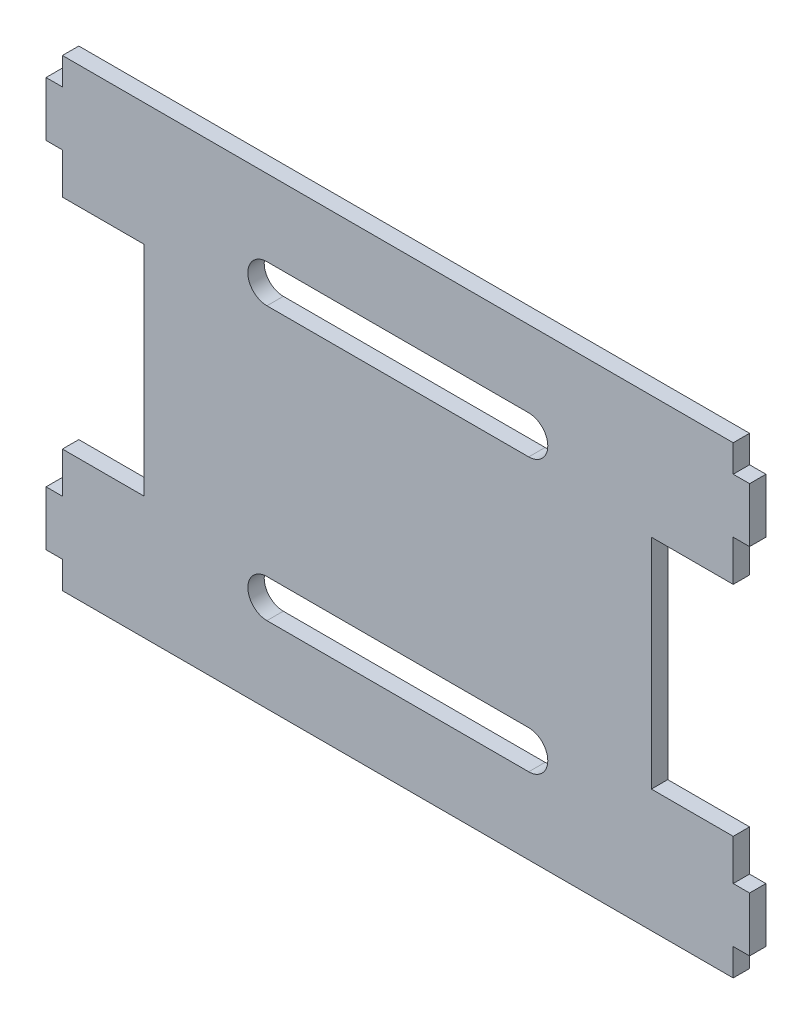
ISO-10303-21;
HEADER;
FILE_DESCRIPTION(('STEP AP214'),'2;1');
FILE_NAME('part.step','',(''),(''),'','','');
FILE_SCHEMA(('AUTOMOTIVE_DESIGN { 1 0 10303 214 1 1 1 1 }'));
ENDSEC;
DATA;
#1=APPLICATION_CONTEXT('core data for automotive mechanical design processes');
#2=APPLICATION_PROTOCOL_DEFINITION('international standard','automotive_design',2000,#1);
#3=PRODUCT_CONTEXT('',#1,'mechanical');
#4=PRODUCT('Part','Part','',(#3));
#5=PRODUCT_RELATED_PRODUCT_CATEGORY('part','',(#4));
#6=PRODUCT_DEFINITION_FORMATION('','',#4);
#7=PRODUCT_DEFINITION_CONTEXT('part definition',#1,'design');
#8=PRODUCT_DEFINITION('design','',#6,#7);
#9=PRODUCT_DEFINITION_SHAPE('','',#8);
#10=(LENGTH_UNIT() NAMED_UNIT(*) SI_UNIT(.MILLI.,.METRE.));
#11=(NAMED_UNIT(*) PLANE_ANGLE_UNIT() SI_UNIT($,.RADIAN.));
#12=(NAMED_UNIT(*) SI_UNIT($,.STERADIAN.) SOLID_ANGLE_UNIT());
#13=UNCERTAINTY_MEASURE_WITH_UNIT(LENGTH_MEASURE(1.E-05),#10,'distance_accuracy_value','');
#14=(GEOMETRIC_REPRESENTATION_CONTEXT(3) GLOBAL_UNCERTAINTY_ASSIGNED_CONTEXT((#13)) GLOBAL_UNIT_ASSIGNED_CONTEXT((#10,
#11,#12)) REPRESENTATION_CONTEXT('',''));
#15=CARTESIAN_POINT('',(0.,0.,0.));
#16=DIRECTION('',(0.,0.,1.));
#17=DIRECTION('',(1.,0.,0.));
#18=AXIS2_PLACEMENT_3D('',#15,#16,#17);
#19=CARTESIAN_POINT('',(0.,0.,3.));
#20=DIRECTION('',(0.,0.,1.));
#21=DIRECTION('',(1.,0.,0.));
#22=AXIS2_PLACEMENT_3D('',#19,#20,#21);
#23=PLANE('',#22);
#24=DIRECTION('',(0.,1.,0.));
#25=VECTOR('',#24,1.);
#26=CARTESIAN_POINT('',(61.5,-37.5,3.));
#27=LINE('',#26,#25);
#28=CARTESIAN_POINT('',(61.5,-42.5,3.));
#29=VERTEX_POINT('',#28);
#30=CARTESIAN_POINT('',(61.5,-37.5,3.));
#31=VERTEX_POINT('',#30);
#32=EDGE_CURVE('E333',#29,#31,#27,.T.);
#33=ORIENTED_EDGE('',*,*,#32,.T.);
#34=DIRECTION('',(1.,0.,0.));
#35=VECTOR('',#34,1.);
#36=CARTESIAN_POINT('',(61.5,-37.5,3.));
#37=LINE('',#36,#35);
#38=CARTESIAN_POINT('',(64.5,-37.5,3.));
#39=VERTEX_POINT('',#38);
#40=EDGE_CURVE('E336',#31,#39,#37,.T.);
#41=ORIENTED_EDGE('',*,*,#40,.T.);
#42=DIRECTION('',(0.,1.,0.));
#43=VECTOR('',#42,1.);
#44=CARTESIAN_POINT('',(64.5,-27.5,3.));
#45=LINE('',#44,#43);
#46=CARTESIAN_POINT('',(64.5,-27.5,3.));
#47=VERTEX_POINT('',#46);
#48=EDGE_CURVE('E339',#39,#47,#45,.T.);
#49=ORIENTED_EDGE('',*,*,#48,.T.);
#50=DIRECTION('',(-1.,0.,0.));
#51=VECTOR('',#50,1.);
#52=CARTESIAN_POINT('',(61.5,-27.5,3.));
#53=LINE('',#52,#51);
#54=CARTESIAN_POINT('',(61.5,-27.5,3.));
#55=VERTEX_POINT('',#54);
#56=EDGE_CURVE('E341',#47,#55,#53,.T.);
#57=ORIENTED_EDGE('',*,*,#56,.T.);
#58=DIRECTION('',(0.,1.,0.));
#59=VECTOR('',#58,1.);
#60=CARTESIAN_POINT('',(61.5,-19.9999999999999,3.));
#61=LINE('',#60,#59);
#62=CARTESIAN_POINT('',(61.5,-19.9999999999999,3.));
#63=VERTEX_POINT('',#62);
#64=EDGE_CURVE('E343',#55,#63,#61,.T.);
#65=ORIENTED_EDGE('',*,*,#64,.T.);
#66=DIRECTION('',(-1.,0.,0.));
#67=VECTOR('',#66,1.);
#68=CARTESIAN_POINT('',(61.5,-19.9999999999999,3.));
#69=LINE('',#68,#67);
#70=CARTESIAN_POINT('',(46.5,-20.,3.));
#71=VERTEX_POINT('',#70);
#72=EDGE_CURVE('E345',#63,#71,#69,.T.);
#73=ORIENTED_EDGE('',*,*,#72,.T.);
#74=DIRECTION('',(0.,1.,0.));
#75=VECTOR('',#74,1.);
#76=CARTESIAN_POINT('',(46.5,20.,3.));
#77=LINE('',#76,#75);
#78=CARTESIAN_POINT('',(46.5,20.,3.));
#79=VERTEX_POINT('',#78);
#80=EDGE_CURVE('E347',#71,#79,#77,.T.);
#81=ORIENTED_EDGE('',*,*,#80,.T.);
#82=DIRECTION('',(1.,0.,0.));
#83=VECTOR('',#82,1.);
#84=CARTESIAN_POINT('',(61.5,20.0000000000001,3.));
#85=LINE('',#84,#83);
#86=CARTESIAN_POINT('',(61.5,20.0000000000001,3.));
#87=VERTEX_POINT('',#86);
#88=EDGE_CURVE('E349',#79,#87,#85,.T.);
#89=ORIENTED_EDGE('',*,*,#88,.T.);
#90=DIRECTION('',(0.,1.,0.));
#91=VECTOR('',#90,1.);
#92=CARTESIAN_POINT('',(61.5,27.5,3.));
#93=LINE('',#92,#91);
#94=CARTESIAN_POINT('',(61.5,27.5,3.));
#95=VERTEX_POINT('',#94);
#96=EDGE_CURVE('E351',#87,#95,#93,.T.);
#97=ORIENTED_EDGE('',*,*,#96,.T.);
#98=DIRECTION('',(1.,0.,0.));
#99=VECTOR('',#98,1.);
#100=CARTESIAN_POINT('',(61.5,27.5,3.));
#101=LINE('',#100,#99);
#102=CARTESIAN_POINT('',(64.5,27.5,3.));
#103=VERTEX_POINT('',#102);
#104=EDGE_CURVE('E353',#95,#103,#101,.T.);
#105=ORIENTED_EDGE('',*,*,#104,.T.);
#106=DIRECTION('',(0.,1.,0.));
#107=VECTOR('',#106,1.);
#108=CARTESIAN_POINT('',(64.5,37.5,3.));
#109=LINE('',#108,#107);
#110=CARTESIAN_POINT('',(64.5,37.5,3.));
#111=VERTEX_POINT('',#110);
#112=EDGE_CURVE('E355',#103,#111,#109,.T.);
#113=ORIENTED_EDGE('',*,*,#112,.T.);
#114=DIRECTION('',(-1.,0.,0.));
#115=VECTOR('',#114,1.);
#116=CARTESIAN_POINT('',(61.5,37.5,3.));
#117=LINE('',#116,#115);
#118=CARTESIAN_POINT('',(61.5,37.5,3.));
#119=VERTEX_POINT('',#118);
#120=EDGE_CURVE('E357',#111,#119,#117,.T.);
#121=ORIENTED_EDGE('',*,*,#120,.T.);
#122=DIRECTION('',(0.,1.,0.));
#123=VECTOR('',#122,1.);
#124=CARTESIAN_POINT('',(61.5,42.5,3.));
#125=LINE('',#124,#123);
#126=CARTESIAN_POINT('',(61.5,42.5,3.));
#127=VERTEX_POINT('',#126);
#128=EDGE_CURVE('E359',#119,#127,#125,.T.);
#129=ORIENTED_EDGE('',*,*,#128,.T.);
#130=DIRECTION('',(-1.,0.,0.));
#131=VECTOR('',#130,1.);
#132=CARTESIAN_POINT('',(-61.5,42.5,3.));
#133=LINE('',#132,#131);
#134=CARTESIAN_POINT('',(-61.5,42.5,3.));
#135=VERTEX_POINT('',#134);
#136=EDGE_CURVE('E361',#127,#135,#133,.T.);
#137=ORIENTED_EDGE('',*,*,#136,.T.);
#138=DIRECTION('',(0.,-1.,0.));
#139=VECTOR('',#138,1.);
#140=CARTESIAN_POINT('',(-61.5,42.5,3.));
#141=LINE('',#140,#139);
#142=CARTESIAN_POINT('',(-61.5,37.5,3.));
#143=VERTEX_POINT('',#142);
#144=EDGE_CURVE('E363',#135,#143,#141,.T.);
#145=ORIENTED_EDGE('',*,*,#144,.T.);
#146=DIRECTION('',(-1.,0.,0.));
#147=VECTOR('',#146,1.);
#148=CARTESIAN_POINT('',(-64.5,37.5,3.));
#149=LINE('',#148,#147);
#150=CARTESIAN_POINT('',(-64.5,37.5,3.));
#151=VERTEX_POINT('',#150);
#152=EDGE_CURVE('E365',#143,#151,#149,.T.);
#153=ORIENTED_EDGE('',*,*,#152,.T.);
#154=DIRECTION('',(0.,-1.,0.));
#155=VECTOR('',#154,1.);
#156=CARTESIAN_POINT('',(-64.5,37.5,3.));
#157=LINE('',#156,#155);
#158=CARTESIAN_POINT('',(-64.5,27.5,3.));
#159=VERTEX_POINT('',#158);
#160=EDGE_CURVE('E367',#151,#159,#157,.T.);
#161=ORIENTED_EDGE('',*,*,#160,.T.);
#162=DIRECTION('',(1.,0.,0.));
#163=VECTOR('',#162,1.);
#164=CARTESIAN_POINT('',(-64.5,27.5,3.));
#165=LINE('',#164,#163);
#166=CARTESIAN_POINT('',(-61.5,27.5,3.));
#167=VERTEX_POINT('',#166);
#168=EDGE_CURVE('E369',#159,#167,#165,.T.);
#169=ORIENTED_EDGE('',*,*,#168,.T.);
#170=DIRECTION('',(0.,-1.,0.));
#171=VECTOR('',#170,1.);
#172=CARTESIAN_POINT('',(-61.5,27.5,3.));
#173=LINE('',#172,#171);
#174=CARTESIAN_POINT('',(-61.5,20.,3.));
#175=VERTEX_POINT('',#174);
#176=EDGE_CURVE('E371',#167,#175,#173,.T.);
#177=ORIENTED_EDGE('',*,*,#176,.T.);
#178=DIRECTION('',(1.,0.,0.));
#179=VECTOR('',#178,1.);
#180=CARTESIAN_POINT('',(-61.5,20.,3.));
#181=LINE('',#180,#179);
#182=CARTESIAN_POINT('',(-46.5,20.,3.));
#183=VERTEX_POINT('',#182);
#184=EDGE_CURVE('E373',#175,#183,#181,.T.);
#185=ORIENTED_EDGE('',*,*,#184,.T.);
#186=DIRECTION('',(0.,-1.,0.));
#187=VECTOR('',#186,1.);
#188=CARTESIAN_POINT('',(-46.5,20.,3.));
#189=LINE('',#188,#187);
#190=CARTESIAN_POINT('',(-46.5,-20.,3.));
#191=VERTEX_POINT('',#190);
#192=EDGE_CURVE('E375',#183,#191,#189,.T.);
#193=ORIENTED_EDGE('',*,*,#192,.T.);
#194=DIRECTION('',(-1.,0.,0.));
#195=VECTOR('',#194,1.);
#196=CARTESIAN_POINT('',(-61.5,-20.,3.));
#197=LINE('',#196,#195);
#198=CARTESIAN_POINT('',(-61.5,-20.,3.));
#199=VERTEX_POINT('',#198);
#200=EDGE_CURVE('E377',#191,#199,#197,.T.);
#201=ORIENTED_EDGE('',*,*,#200,.T.);
#202=DIRECTION('',(0.,-1.,0.));
#203=VECTOR('',#202,1.);
#204=CARTESIAN_POINT('',(-61.5,-20.,3.));
#205=LINE('',#204,#203);
#206=CARTESIAN_POINT('',(-61.5,-27.5,3.));
#207=VERTEX_POINT('',#206);
#208=EDGE_CURVE('E379',#199,#207,#205,.T.);
#209=ORIENTED_EDGE('',*,*,#208,.T.);
#210=DIRECTION('',(-1.,0.,0.));
#211=VECTOR('',#210,1.);
#212=CARTESIAN_POINT('',(-64.5,-27.5,3.));
#213=LINE('',#212,#211);
#214=CARTESIAN_POINT('',(-64.5,-27.5,3.));
#215=VERTEX_POINT('',#214);
#216=EDGE_CURVE('E381',#207,#215,#213,.T.);
#217=ORIENTED_EDGE('',*,*,#216,.T.);
#218=DIRECTION('',(0.,-1.,0.));
#219=VECTOR('',#218,1.);
#220=CARTESIAN_POINT('',(-64.5,-27.5,3.));
#221=LINE('',#220,#219);
#222=CARTESIAN_POINT('',(-64.5,-37.5,3.));
#223=VERTEX_POINT('',#222);
#224=EDGE_CURVE('E383',#215,#223,#221,.T.);
#225=ORIENTED_EDGE('',*,*,#224,.T.);
#226=DIRECTION('',(1.,0.,0.));
#227=VECTOR('',#226,1.);
#228=CARTESIAN_POINT('',(-64.5,-37.5,3.));
#229=LINE('',#228,#227);
#230=CARTESIAN_POINT('',(-61.5,-37.5,3.));
#231=VERTEX_POINT('',#230);
#232=EDGE_CURVE('E385',#223,#231,#229,.T.);
#233=ORIENTED_EDGE('',*,*,#232,.T.);
#234=DIRECTION('',(0.,-1.,0.));
#235=VECTOR('',#234,1.);
#236=CARTESIAN_POINT('',(-61.5,-37.5,3.));
#237=LINE('',#236,#235);
#238=CARTESIAN_POINT('',(-61.5,-42.5,3.));
#239=VERTEX_POINT('',#238);
#240=EDGE_CURVE('E387',#231,#239,#237,.T.);
#241=ORIENTED_EDGE('',*,*,#240,.T.);
#242=DIRECTION('',(1.,0.,0.));
#243=VECTOR('',#242,1.);
#244=CARTESIAN_POINT('',(-61.5,-42.5,3.));
#245=LINE('',#244,#243);
#246=EDGE_CURVE('E389',#239,#29,#245,.T.);
#247=ORIENTED_EDGE('',*,*,#246,.T.);
#248=EDGE_LOOP('',(#33,#41,#49,#57,#65,#73,#81,#89,#97,#105,#113,#121,#129,#137,#145,#153,#161,
#169,#177,#185,#193,#201,#209,#217,#225,#233,#241,#247));
#249=FACE_BOUND('',#248,.T.);
#250=DIRECTION('',(1.,0.,0.));
#251=VECTOR('',#250,1.);
#252=CARTESIAN_POINT('',(-24.,21.5,3.));
#253=LINE('',#252,#251);
#254=CARTESIAN_POINT('',(-24.,21.5,3.));
#255=VERTEX_POINT('',#254);
#256=CARTESIAN_POINT('',(24.,21.5,3.));
#257=VERTEX_POINT('',#256);
#258=EDGE_CURVE('E304',#255,#257,#253,.T.);
#259=ORIENTED_EDGE('',*,*,#258,.F.);
#260=CARTESIAN_POINT('',(-24.,25.,3.));
#261=DIRECTION('',(0.,0.,1.));
#262=DIRECTION('',(1.,0.,0.));
#263=AXIS2_PLACEMENT_3D('',#260,#261,#262);
#264=CIRCLE('',#263,3.5);
#265=CARTESIAN_POINT('',(-24.,28.5,3.));
#266=VERTEX_POINT('',#265);
#267=EDGE_CURVE('E302',#266,#255,#264,.T.);
#268=ORIENTED_EDGE('',*,*,#267,.F.);
#269=DIRECTION('',(-1.,0.,0.));
#270=VECTOR('',#269,1.);
#271=CARTESIAN_POINT('',(-24.,28.5,3.));
#272=LINE('',#271,#270);
#273=CARTESIAN_POINT('',(24.,28.5,3.));
#274=VERTEX_POINT('',#273);
#275=EDGE_CURVE('E310',#274,#266,#272,.T.);
#276=ORIENTED_EDGE('',*,*,#275,.F.);
#277=CARTESIAN_POINT('',(24.,25.,3.));
#278=DIRECTION('',(0.,0.,1.));
#279=DIRECTION('',(1.,0.,0.));
#280=AXIS2_PLACEMENT_3D('',#277,#278,#279);
#281=CIRCLE('',#280,3.5);
#282=EDGE_CURVE('E307',#257,#274,#281,.T.);
#283=ORIENTED_EDGE('',*,*,#282,.F.);
#284=EDGE_LOOP('',(#259,#268,#276,#283));
#285=FACE_BOUND('',#284,.T.);
#286=DIRECTION('',(1.,0.,0.));
#287=VECTOR('',#286,1.);
#288=CARTESIAN_POINT('',(-24.,-28.5,3.));
#289=LINE('',#288,#287);
#290=CARTESIAN_POINT('',(-24.,-28.5,3.));
#291=VERTEX_POINT('',#290);
#292=CARTESIAN_POINT('',(24.,-28.5,3.));
#293=VERTEX_POINT('',#292);
#294=EDGE_CURVE('E274',#291,#293,#289,.T.);
#295=ORIENTED_EDGE('',*,*,#294,.F.);
#296=CARTESIAN_POINT('',(-24.,-25.,3.));
#297=DIRECTION('',(0.,0.,1.));
#298=DIRECTION('',(1.,0.,0.));
#299=AXIS2_PLACEMENT_3D('',#296,#297,#298);
#300=CIRCLE('',#299,3.5);
#301=CARTESIAN_POINT('',(-24.,-21.5,3.));
#302=VERTEX_POINT('',#301);
#303=EDGE_CURVE('E266',#302,#291,#300,.T.);
#304=ORIENTED_EDGE('',*,*,#303,.F.);
#305=DIRECTION('',(-1.,0.,0.));
#306=VECTOR('',#305,1.);
#307=CARTESIAN_POINT('',(-24.,-21.5,3.));
#308=LINE('',#307,#306);
#309=CARTESIAN_POINT('',(24.,-21.5,3.));
#310=VERTEX_POINT('',#309);
#311=EDGE_CURVE('E288',#310,#302,#308,.T.);
#312=ORIENTED_EDGE('',*,*,#311,.F.);
#313=CARTESIAN_POINT('',(24.,-25.,3.));
#314=DIRECTION('',(0.,0.,1.));
#315=DIRECTION('',(1.,0.,0.));
#316=AXIS2_PLACEMENT_3D('',#313,#314,#315);
#317=CIRCLE('',#316,3.5);
#318=EDGE_CURVE('E286',#293,#310,#317,.T.);
#319=ORIENTED_EDGE('',*,*,#318,.F.);
#320=EDGE_LOOP('',(#295,#304,#312,#319));
#321=FACE_BOUND('',#320,.T.);
#322=ADVANCED_FACE('F33',(#249,#285,#321),#23,.T.);
#323=CARTESIAN_POINT('',(0.,0.,0.));
#324=DIRECTION('',(0.,0.,1.));
#325=DIRECTION('',(1.,0.,0.));
#326=AXIS2_PLACEMENT_3D('',#323,#324,#325);
#327=PLANE('',#326);
#328=CARTESIAN_POINT('',(-24.,25.,0.));
#329=DIRECTION('',(0.,0.,1.));
#330=DIRECTION('',(1.,0.,0.));
#331=AXIS2_PLACEMENT_3D('',#328,#329,#330);
#332=CIRCLE('',#331,3.5);
#333=CARTESIAN_POINT('',(-24.,28.5,0.));
#334=VERTEX_POINT('',#333);
#335=CARTESIAN_POINT('',(-24.,21.5,0.));
#336=VERTEX_POINT('',#335);
#337=EDGE_CURVE('E282',#334,#336,#332,.T.);
#338=ORIENTED_EDGE('',*,*,#337,.T.);
#339=DIRECTION('',(1.,0.,0.));
#340=VECTOR('',#339,1.);
#341=CARTESIAN_POINT('',(-24.,21.5,0.));
#342=LINE('',#341,#340);
#343=CARTESIAN_POINT('',(24.,21.5,0.));
#344=VERTEX_POINT('',#343);
#345=EDGE_CURVE('E315',#336,#344,#342,.T.);
#346=ORIENTED_EDGE('',*,*,#345,.T.);
#347=CARTESIAN_POINT('',(24.,25.,0.));
#348=DIRECTION('',(0.,0.,1.));
#349=DIRECTION('',(1.,0.,0.));
#350=AXIS2_PLACEMENT_3D('',#347,#348,#349);
#351=CIRCLE('',#350,3.5);
#352=CARTESIAN_POINT('',(24.,28.5,0.));
#353=VERTEX_POINT('',#352);
#354=EDGE_CURVE('E318',#344,#353,#351,.T.);
#355=ORIENTED_EDGE('',*,*,#354,.T.);
#356=DIRECTION('',(-1.,0.,0.));
#357=VECTOR('',#356,1.);
#358=CARTESIAN_POINT('',(-24.,28.5,0.));
#359=LINE('',#358,#357);
#360=EDGE_CURVE('E305',#353,#334,#359,.T.);
#361=ORIENTED_EDGE('',*,*,#360,.T.);
#362=EDGE_LOOP('',(#338,#346,#355,#361));
#363=FACE_BOUND('',#362,.T.);
#364=DIRECTION('',(0.,1.,0.));
#365=VECTOR('',#364,1.);
#366=CARTESIAN_POINT('',(61.5,-37.5,0.));
#367=LINE('',#366,#365);
#368=CARTESIAN_POINT('',(61.5,-42.5,0.));
#369=VERTEX_POINT('',#368);
#370=CARTESIAN_POINT('',(61.5,-37.5,0.));
#371=VERTEX_POINT('',#370);
#372=EDGE_CURVE('E332',#369,#371,#367,.T.);
#373=ORIENTED_EDGE('',*,*,#372,.F.);
#374=DIRECTION('',(1.,0.,0.));
#375=VECTOR('',#374,1.);
#376=CARTESIAN_POINT('',(-61.5,-42.5,0.));
#377=LINE('',#376,#375);
#378=CARTESIAN_POINT('',(-61.5,-42.5,0.));
#379=VERTEX_POINT('',#378);
#380=EDGE_CURVE('E337',#379,#369,#377,.T.);
#381=ORIENTED_EDGE('',*,*,#380,.F.);
#382=DIRECTION('',(0.,-1.,0.));
#383=VECTOR('',#382,1.);
#384=CARTESIAN_POINT('',(-61.5,-37.5,0.));
#385=LINE('',#384,#383);
#386=CARTESIAN_POINT('',(-61.5,-37.5,0.));
#387=VERTEX_POINT('',#386);
#388=EDGE_CURVE('E444',#387,#379,#385,.T.);
#389=ORIENTED_EDGE('',*,*,#388,.F.);
#390=DIRECTION('',(1.,0.,0.));
#391=VECTOR('',#390,1.);
#392=CARTESIAN_POINT('',(-64.5,-37.5,0.));
#393=LINE('',#392,#391);
#394=CARTESIAN_POINT('',(-64.5,-37.5,0.));
#395=VERTEX_POINT('',#394);
#396=EDGE_CURVE('E442',#395,#387,#393,.T.);
#397=ORIENTED_EDGE('',*,*,#396,.F.);
#398=DIRECTION('',(0.,-1.,0.));
#399=VECTOR('',#398,1.);
#400=CARTESIAN_POINT('',(-64.5,-27.5,0.));
#401=LINE('',#400,#399);
#402=CARTESIAN_POINT('',(-64.5,-27.5,0.));
#403=VERTEX_POINT('',#402);
#404=EDGE_CURVE('E440',#403,#395,#401,.T.);
#405=ORIENTED_EDGE('',*,*,#404,.F.);
#406=DIRECTION('',(-1.,0.,0.));
#407=VECTOR('',#406,1.);
#408=CARTESIAN_POINT('',(-64.5,-27.5,0.));
#409=LINE('',#408,#407);
#410=CARTESIAN_POINT('',(-61.5,-27.5,0.));
#411=VERTEX_POINT('',#410);
#412=EDGE_CURVE('E438',#411,#403,#409,.T.);
#413=ORIENTED_EDGE('',*,*,#412,.F.);
#414=DIRECTION('',(0.,-1.,0.));
#415=VECTOR('',#414,1.);
#416=CARTESIAN_POINT('',(-61.5,-20.,0.));
#417=LINE('',#416,#415);
#418=CARTESIAN_POINT('',(-61.5,-20.,0.));
#419=VERTEX_POINT('',#418);
#420=EDGE_CURVE('E436',#419,#411,#417,.T.);
#421=ORIENTED_EDGE('',*,*,#420,.F.);
#422=DIRECTION('',(-1.,0.,0.));
#423=VECTOR('',#422,1.);
#424=CARTESIAN_POINT('',(-61.5,-20.,0.));
#425=LINE('',#424,#423);
#426=CARTESIAN_POINT('',(-46.5,-20.,0.));
#427=VERTEX_POINT('',#426);
#428=EDGE_CURVE('E434',#427,#419,#425,.T.);
#429=ORIENTED_EDGE('',*,*,#428,.F.);
#430=DIRECTION('',(0.,-1.,0.));
#431=VECTOR('',#430,1.);
#432=CARTESIAN_POINT('',(-46.5,20.,0.));
#433=LINE('',#432,#431);
#434=CARTESIAN_POINT('',(-46.5,20.,0.));
#435=VERTEX_POINT('',#434);
#436=EDGE_CURVE('E432',#435,#427,#433,.T.);
#437=ORIENTED_EDGE('',*,*,#436,.F.);
#438=DIRECTION('',(1.,0.,0.));
#439=VECTOR('',#438,1.);
#440=CARTESIAN_POINT('',(-61.5,20.,0.));
#441=LINE('',#440,#439);
#442=CARTESIAN_POINT('',(-61.5,20.,0.));
#443=VERTEX_POINT('',#442);
#444=EDGE_CURVE('E430',#443,#435,#441,.T.);
#445=ORIENTED_EDGE('',*,*,#444,.F.);
#446=DIRECTION('',(0.,-1.,0.));
#447=VECTOR('',#446,1.);
#448=CARTESIAN_POINT('',(-61.5,27.5,0.));
#449=LINE('',#448,#447);
#450=CARTESIAN_POINT('',(-61.5,27.5,0.));
#451=VERTEX_POINT('',#450);
#452=EDGE_CURVE('E428',#451,#443,#449,.T.);
#453=ORIENTED_EDGE('',*,*,#452,.F.);
#454=DIRECTION('',(1.,0.,0.));
#455=VECTOR('',#454,1.);
#456=CARTESIAN_POINT('',(-64.5,27.5,0.));
#457=LINE('',#456,#455);
#458=CARTESIAN_POINT('',(-64.5,27.5,0.));
#459=VERTEX_POINT('',#458);
#460=EDGE_CURVE('E426',#459,#451,#457,.T.);
#461=ORIENTED_EDGE('',*,*,#460,.F.);
#462=DIRECTION('',(0.,-1.,0.));
#463=VECTOR('',#462,1.);
#464=CARTESIAN_POINT('',(-64.5,37.5,0.));
#465=LINE('',#464,#463);
#466=CARTESIAN_POINT('',(-64.5,37.5,0.));
#467=VERTEX_POINT('',#466);
#468=EDGE_CURVE('E424',#467,#459,#465,.T.);
#469=ORIENTED_EDGE('',*,*,#468,.F.);
#470=DIRECTION('',(-1.,0.,0.));
#471=VECTOR('',#470,1.);
#472=CARTESIAN_POINT('',(-64.5,37.5,0.));
#473=LINE('',#472,#471);
#474=CARTESIAN_POINT('',(-61.5,37.5,0.));
#475=VERTEX_POINT('',#474);
#476=EDGE_CURVE('E422',#475,#467,#473,.T.);
#477=ORIENTED_EDGE('',*,*,#476,.F.);
#478=DIRECTION('',(0.,-1.,0.));
#479=VECTOR('',#478,1.);
#480=CARTESIAN_POINT('',(-61.5,42.5,0.));
#481=LINE('',#480,#479);
#482=CARTESIAN_POINT('',(-61.5,42.5,0.));
#483=VERTEX_POINT('',#482);
#484=EDGE_CURVE('E420',#483,#475,#481,.T.);
#485=ORIENTED_EDGE('',*,*,#484,.F.);
#486=DIRECTION('',(-1.,0.,0.));
#487=VECTOR('',#486,1.);
#488=CARTESIAN_POINT('',(-61.5,42.5,0.));
#489=LINE('',#488,#487);
#490=CARTESIAN_POINT('',(61.5,42.5,0.));
#491=VERTEX_POINT('',#490);
#492=EDGE_CURVE('E418',#491,#483,#489,.T.);
#493=ORIENTED_EDGE('',*,*,#492,.F.);
#494=DIRECTION('',(0.,1.,0.));
#495=VECTOR('',#494,1.);
#496=CARTESIAN_POINT('',(61.5,42.5,0.));
#497=LINE('',#496,#495);
#498=CARTESIAN_POINT('',(61.5,37.5,0.));
#499=VERTEX_POINT('',#498);
#500=EDGE_CURVE('E416',#499,#491,#497,.T.);
#501=ORIENTED_EDGE('',*,*,#500,.F.);
#502=DIRECTION('',(-1.,0.,0.));
#503=VECTOR('',#502,1.);
#504=CARTESIAN_POINT('',(61.5,37.5,0.));
#505=LINE('',#504,#503);
#506=CARTESIAN_POINT('',(64.5,37.5,0.));
#507=VERTEX_POINT('',#506);
#508=EDGE_CURVE('E414',#507,#499,#505,.T.);
#509=ORIENTED_EDGE('',*,*,#508,.F.);
#510=DIRECTION('',(0.,1.,0.));
#511=VECTOR('',#510,1.);
#512=CARTESIAN_POINT('',(64.5,37.5,0.));
#513=LINE('',#512,#511);
#514=CARTESIAN_POINT('',(64.5,27.5,0.));
#515=VERTEX_POINT('',#514);
#516=EDGE_CURVE('E412',#515,#507,#513,.T.);
#517=ORIENTED_EDGE('',*,*,#516,.F.);
#518=DIRECTION('',(1.,0.,0.));
#519=VECTOR('',#518,1.);
#520=CARTESIAN_POINT('',(61.5,27.5,0.));
#521=LINE('',#520,#519);
#522=CARTESIAN_POINT('',(61.5,27.5,0.));
#523=VERTEX_POINT('',#522);
#524=EDGE_CURVE('E410',#523,#515,#521,.T.);
#525=ORIENTED_EDGE('',*,*,#524,.F.);
#526=DIRECTION('',(0.,1.,0.));
#527=VECTOR('',#526,1.);
#528=CARTESIAN_POINT('',(61.5,27.5,0.));
#529=LINE('',#528,#527);
#530=CARTESIAN_POINT('',(61.5,20.0000000000001,0.));
#531=VERTEX_POINT('',#530);
#532=EDGE_CURVE('E408',#531,#523,#529,.T.);
#533=ORIENTED_EDGE('',*,*,#532,.F.);
#534=DIRECTION('',(1.,0.,0.));
#535=VECTOR('',#534,1.);
#536=CARTESIAN_POINT('',(61.5,20.0000000000001,0.));
#537=LINE('',#536,#535);
#538=CARTESIAN_POINT('',(46.5,20.,0.));
#539=VERTEX_POINT('',#538);
#540=EDGE_CURVE('E406',#539,#531,#537,.T.);
#541=ORIENTED_EDGE('',*,*,#540,.F.);
#542=DIRECTION('',(0.,1.,0.));
#543=VECTOR('',#542,1.);
#544=CARTESIAN_POINT('',(46.5,20.,0.));
#545=LINE('',#544,#543);
#546=CARTESIAN_POINT('',(46.5,-20.,0.));
#547=VERTEX_POINT('',#546);
#548=EDGE_CURVE('E404',#547,#539,#545,.T.);
#549=ORIENTED_EDGE('',*,*,#548,.F.);
#550=DIRECTION('',(-1.,0.,0.));
#551=VECTOR('',#550,1.);
#552=CARTESIAN_POINT('',(61.5,-19.9999999999999,0.));
#553=LINE('',#552,#551);
#554=CARTESIAN_POINT('',(61.5,-19.9999999999999,0.));
#555=VERTEX_POINT('',#554);
#556=EDGE_CURVE('E402',#555,#547,#553,.T.);
#557=ORIENTED_EDGE('',*,*,#556,.F.);
#558=DIRECTION('',(0.,1.,0.));
#559=VECTOR('',#558,1.);
#560=CARTESIAN_POINT('',(61.5,-19.9999999999999,0.));
#561=LINE('',#560,#559);
#562=CARTESIAN_POINT('',(61.5,-27.5,0.));
#563=VERTEX_POINT('',#562);
#564=EDGE_CURVE('E400',#563,#555,#561,.T.);
#565=ORIENTED_EDGE('',*,*,#564,.F.);
#566=DIRECTION('',(-1.,0.,0.));
#567=VECTOR('',#566,1.);
#568=CARTESIAN_POINT('',(61.5,-27.5,0.));
#569=LINE('',#568,#567);
#570=CARTESIAN_POINT('',(64.5,-27.5,0.));
#571=VERTEX_POINT('',#570);
#572=EDGE_CURVE('E398',#571,#563,#569,.T.);
#573=ORIENTED_EDGE('',*,*,#572,.F.);
#574=DIRECTION('',(0.,1.,0.));
#575=VECTOR('',#574,1.);
#576=CARTESIAN_POINT('',(64.5,-27.5,0.));
#577=LINE('',#576,#575);
#578=CARTESIAN_POINT('',(64.5,-37.5,0.));
#579=VERTEX_POINT('',#578);
#580=EDGE_CURVE('E396',#579,#571,#577,.T.);
#581=ORIENTED_EDGE('',*,*,#580,.F.);
#582=DIRECTION('',(1.,0.,0.));
#583=VECTOR('',#582,1.);
#584=CARTESIAN_POINT('',(61.5,-37.5,0.));
#585=LINE('',#584,#583);
#586=EDGE_CURVE('E394',#371,#579,#585,.T.);
#587=ORIENTED_EDGE('',*,*,#586,.F.);
#588=EDGE_LOOP('',(#373,#381,#389,#397,#405,#413,#421,#429,#437,#445,#453,#461,#469,#477,#485,
#493,#501,#509,#517,#525,#533,#541,#549,#557,#565,#573,#581,#587));
#589=FACE_BOUND('',#588,.T.);
#590=CARTESIAN_POINT('',(-24.,-25.,0.));
#591=DIRECTION('',(0.,0.,1.));
#592=DIRECTION('',(1.,0.,0.));
#593=AXIS2_PLACEMENT_3D('',#590,#591,#592);
#594=CIRCLE('',#593,3.5);
#595=CARTESIAN_POINT('',(-24.,-21.5,0.));
#596=VERTEX_POINT('',#595);
#597=CARTESIAN_POINT('',(-24.,-28.5,0.));
#598=VERTEX_POINT('',#597);
#599=EDGE_CURVE('E56',#596,#598,#594,.T.);
#600=ORIENTED_EDGE('',*,*,#599,.T.);
#601=DIRECTION('',(1.,0.,0.));
#602=VECTOR('',#601,1.);
#603=CARTESIAN_POINT('',(-24.,-28.5,0.));
#604=LINE('',#603,#602);
#605=CARTESIAN_POINT('',(24.,-28.5,0.));
#606=VERTEX_POINT('',#605);
#607=EDGE_CURVE('E281',#598,#606,#604,.T.);
#608=ORIENTED_EDGE('',*,*,#607,.T.);
#609=CARTESIAN_POINT('',(24.,-25.,0.));
#610=DIRECTION('',(0.,0.,1.));
#611=DIRECTION('',(1.,0.,0.));
#612=AXIS2_PLACEMENT_3D('',#609,#610,#611);
#613=CIRCLE('',#612,3.5);
#614=CARTESIAN_POINT('',(24.,-21.5,0.));
#615=VERTEX_POINT('',#614);
#616=EDGE_CURVE('E294',#606,#615,#613,.T.);
#617=ORIENTED_EDGE('',*,*,#616,.T.);
#618=DIRECTION('',(-1.,0.,0.));
#619=VECTOR('',#618,1.);
#620=CARTESIAN_POINT('',(-24.,-21.5,0.));
#621=LINE('',#620,#619);
#622=EDGE_CURVE('E275',#615,#596,#621,.T.);
#623=ORIENTED_EDGE('',*,*,#622,.T.);
#624=EDGE_LOOP('',(#600,#608,#617,#623));
#625=FACE_BOUND('',#624,.T.);
#626=ADVANCED_FACE('F534',(#363,#589,#625),#327,.F.);
#627=CARTESIAN_POINT('',(61.5,-37.5,3.));
#628=DIRECTION('',(-1.,0.,0.));
#629=DIRECTION('',(0.,0.,1.));
#630=AXIS2_PLACEMENT_3D('',#627,#628,#629);
#631=PLANE('',#630);
#632=ORIENTED_EDGE('',*,*,#372,.T.);
#633=DIRECTION('',(0.,0.,-1.));
#634=VECTOR('',#633,1.);
#635=CARTESIAN_POINT('',(61.5,-37.5,3.));
#636=LINE('',#635,#634);
#637=EDGE_CURVE('E11',#31,#371,#636,.T.);
#638=ORIENTED_EDGE('',*,*,#637,.F.);
#639=ORIENTED_EDGE('',*,*,#32,.F.);
#640=DIRECTION('',(0.,0.,-1.));
#641=VECTOR('',#640,1.);
#642=CARTESIAN_POINT('',(61.5,-42.5,3.));
#643=LINE('',#642,#641);
#644=EDGE_CURVE('E391',#29,#369,#643,.T.);
#645=ORIENTED_EDGE('',*,*,#644,.T.);
#646=EDGE_LOOP('',(#632,#638,#639,#645));
#647=FACE_BOUND('',#646,.T.);
#648=ADVANCED_FACE('F35',(#647),#631,.F.);
#649=CARTESIAN_POINT('',(61.5,-37.5,3.));
#650=DIRECTION('',(0.,1.,0.));
#651=DIRECTION('',(0.,0.,1.));
#652=AXIS2_PLACEMENT_3D('',#649,#650,#651);
#653=PLANE('',#652);
#654=ORIENTED_EDGE('',*,*,#586,.T.);
#655=DIRECTION('',(0.,0.,-1.));
#656=VECTOR('',#655,1.);
#657=CARTESIAN_POINT('',(64.5,-37.5,3.));
#658=LINE('',#657,#656);
#659=EDGE_CURVE('E41',#39,#579,#658,.T.);
#660=ORIENTED_EDGE('',*,*,#659,.F.);
#661=ORIENTED_EDGE('',*,*,#40,.F.);
#662=ORIENTED_EDGE('',*,*,#637,.T.);
#663=EDGE_LOOP('',(#654,#660,#661,#662));
#664=FACE_BOUND('',#663,.T.);
#665=ADVANCED_FACE('F552',(#664),#653,.F.);
#666=CARTESIAN_POINT('',(64.5,-27.5,3.));
#667=DIRECTION('',(-1.,0.,0.));
#668=DIRECTION('',(0.,0.,1.));
#669=AXIS2_PLACEMENT_3D('',#666,#667,#668);
#670=PLANE('',#669);
#671=ORIENTED_EDGE('',*,*,#580,.T.);
#672=DIRECTION('',(0.,0.,-1.));
#673=VECTOR('',#672,1.);
#674=CARTESIAN_POINT('',(64.5,-27.5,3.));
#675=LINE('',#674,#673);
#676=EDGE_CURVE('E521',#47,#571,#675,.T.);
#677=ORIENTED_EDGE('',*,*,#676,.F.);
#678=ORIENTED_EDGE('',*,*,#48,.F.);
#679=ORIENTED_EDGE('',*,*,#659,.T.);
#680=EDGE_LOOP('',(#671,#677,#678,#679));
#681=FACE_BOUND('',#680,.T.);
#682=ADVANCED_FACE('F528',(#681),#670,.F.);
#683=CARTESIAN_POINT('',(61.5,-27.5,3.));
#684=DIRECTION('',(0.,-1.,0.));
#685=DIRECTION('',(0.,0.,-1.));
#686=AXIS2_PLACEMENT_3D('',#683,#684,#685);
#687=PLANE('',#686);
#688=ORIENTED_EDGE('',*,*,#572,.T.);
#689=DIRECTION('',(0.,0.,-1.));
#690=VECTOR('',#689,1.);
#691=CARTESIAN_POINT('',(61.5,-27.5,3.));
#692=LINE('',#691,#690);
#693=EDGE_CURVE('E518',#55,#563,#692,.T.);
#694=ORIENTED_EDGE('',*,*,#693,.F.);
#695=ORIENTED_EDGE('',*,*,#56,.F.);
#696=ORIENTED_EDGE('',*,*,#676,.T.);
#697=EDGE_LOOP('',(#688,#694,#695,#696));
#698=FACE_BOUND('',#697,.T.);
#699=ADVANCED_FACE('F540',(#698),#687,.F.);
#700=CARTESIAN_POINT('',(61.5,-19.9999999999999,3.));
#701=DIRECTION('',(-1.,0.,0.));
#702=DIRECTION('',(0.,0.,1.));
#703=AXIS2_PLACEMENT_3D('',#700,#701,#702);
#704=PLANE('',#703);
#705=ORIENTED_EDGE('',*,*,#564,.T.);
#706=DIRECTION('',(0.,0.,-1.));
#707=VECTOR('',#706,1.);
#708=CARTESIAN_POINT('',(61.5,-19.9999999999999,3.));
#709=LINE('',#708,#707);
#710=EDGE_CURVE('E515',#63,#555,#709,.T.);
#711=ORIENTED_EDGE('',*,*,#710,.F.);
#712=ORIENTED_EDGE('',*,*,#64,.F.);
#713=ORIENTED_EDGE('',*,*,#693,.T.);
#714=EDGE_LOOP('',(#705,#711,#712,#713));
#715=FACE_BOUND('',#714,.T.);
#716=ADVANCED_FACE('F544',(#715),#704,.F.);
#717=CARTESIAN_POINT('',(61.5,-19.9999999999999,3.));
#718=DIRECTION('',(0.,-1.,0.));
#719=DIRECTION('',(1.,0.,0.));
#720=AXIS2_PLACEMENT_3D('',#717,#718,#719);
#721=PLANE('',#720);
#722=ORIENTED_EDGE('',*,*,#556,.T.);
#723=DIRECTION('',(0.,0.,-1.));
#724=VECTOR('',#723,1.);
#725=CARTESIAN_POINT('',(46.5,-20.,3.));
#726=LINE('',#725,#724);
#727=EDGE_CURVE('E512',#71,#547,#726,.T.);
#728=ORIENTED_EDGE('',*,*,#727,.F.);
#729=ORIENTED_EDGE('',*,*,#72,.F.);
#730=ORIENTED_EDGE('',*,*,#710,.T.);
#731=EDGE_LOOP('',(#722,#728,#729,#730));
#732=FACE_BOUND('',#731,.T.);
#733=ADVANCED_FACE('F665',(#732),#721,.F.);
#734=CARTESIAN_POINT('',(46.5,20.,3.));
#735=DIRECTION('',(-1.,0.,0.));
#736=DIRECTION('',(0.,-1.,0.));
#737=AXIS2_PLACEMENT_3D('',#734,#735,#736);
#738=PLANE('',#737);
#739=ORIENTED_EDGE('',*,*,#548,.T.);
#740=DIRECTION('',(0.,0.,-1.));
#741=VECTOR('',#740,1.);
#742=CARTESIAN_POINT('',(46.5,20.,3.));
#743=LINE('',#742,#741);
#744=EDGE_CURVE('E509',#79,#539,#743,.T.);
#745=ORIENTED_EDGE('',*,*,#744,.F.);
#746=ORIENTED_EDGE('',*,*,#80,.F.);
#747=ORIENTED_EDGE('',*,*,#727,.T.);
#748=EDGE_LOOP('',(#739,#745,#746,#747));
#749=FACE_BOUND('',#748,.T.);
#750=ADVANCED_FACE('F662',(#749),#738,.F.);
#751=CARTESIAN_POINT('',(61.5,20.0000000000001,3.));
#752=DIRECTION('',(0.,1.,0.));
#753=DIRECTION('',(-1.,0.,0.));
#754=AXIS2_PLACEMENT_3D('',#751,#752,#753);
#755=PLANE('',#754);
#756=ORIENTED_EDGE('',*,*,#540,.T.);
#757=DIRECTION('',(0.,0.,-1.));
#758=VECTOR('',#757,1.);
#759=CARTESIAN_POINT('',(61.5,20.0000000000001,3.));
#760=LINE('',#759,#758);
#761=EDGE_CURVE('E506',#87,#531,#760,.T.);
#762=ORIENTED_EDGE('',*,*,#761,.F.);
#763=ORIENTED_EDGE('',*,*,#88,.F.);
#764=ORIENTED_EDGE('',*,*,#744,.T.);
#765=EDGE_LOOP('',(#756,#762,#763,#764));
#766=FACE_BOUND('',#765,.T.);
#767=ADVANCED_FACE('F658',(#766),#755,.F.);
#768=CARTESIAN_POINT('',(61.5,27.5,3.));
#769=DIRECTION('',(-1.,0.,0.));
#770=DIRECTION('',(0.,-1.,0.));
#771=AXIS2_PLACEMENT_3D('',#768,#769,#770);
#772=PLANE('',#771);
#773=ORIENTED_EDGE('',*,*,#532,.T.);
#774=DIRECTION('',(0.,0.,-1.));
#775=VECTOR('',#774,1.);
#776=CARTESIAN_POINT('',(61.5,27.5,3.));
#777=LINE('',#776,#775);
#778=EDGE_CURVE('E503',#95,#523,#777,.T.);
#779=ORIENTED_EDGE('',*,*,#778,.F.);
#780=ORIENTED_EDGE('',*,*,#96,.F.);
#781=ORIENTED_EDGE('',*,*,#761,.T.);
#782=EDGE_LOOP('',(#773,#779,#780,#781));
#783=FACE_BOUND('',#782,.T.);
#784=ADVANCED_FACE('F654',(#783),#772,.F.);
#785=CARTESIAN_POINT('',(61.5,27.5,3.));
#786=DIRECTION('',(0.,1.,0.));
#787=DIRECTION('',(0.,0.,1.));
#788=AXIS2_PLACEMENT_3D('',#785,#786,#787);
#789=PLANE('',#788);
#790=ORIENTED_EDGE('',*,*,#524,.T.);
#791=DIRECTION('',(0.,0.,-1.));
#792=VECTOR('',#791,1.);
#793=CARTESIAN_POINT('',(64.5,27.5,3.));
#794=LINE('',#793,#792);
#795=EDGE_CURVE('E500',#103,#515,#794,.T.);
#796=ORIENTED_EDGE('',*,*,#795,.F.);
#797=ORIENTED_EDGE('',*,*,#104,.F.);
#798=ORIENTED_EDGE('',*,*,#778,.T.);
#799=EDGE_LOOP('',(#790,#796,#797,#798));
#800=FACE_BOUND('',#799,.T.);
#801=ADVANCED_FACE('F649',(#800),#789,.F.);
#802=CARTESIAN_POINT('',(64.5,37.5,3.));
#803=DIRECTION('',(-1.,0.,0.));
#804=DIRECTION('',(0.,0.,1.));
#805=AXIS2_PLACEMENT_3D('',#802,#803,#804);
#806=PLANE('',#805);
#807=ORIENTED_EDGE('',*,*,#516,.T.);
#808=DIRECTION('',(0.,0.,-1.));
#809=VECTOR('',#808,1.);
#810=CARTESIAN_POINT('',(64.5,37.5,3.));
#811=LINE('',#810,#809);
#812=EDGE_CURVE('E497',#111,#507,#811,.T.);
#813=ORIENTED_EDGE('',*,*,#812,.F.);
#814=ORIENTED_EDGE('',*,*,#112,.F.);
#815=ORIENTED_EDGE('',*,*,#795,.T.);
#816=EDGE_LOOP('',(#807,#813,#814,#815));
#817=FACE_BOUND('',#816,.T.);
#818=ADVANCED_FACE('F643',(#817),#806,.F.);
#819=CARTESIAN_POINT('',(61.5,37.5,3.));
#820=DIRECTION('',(0.,-1.,0.));
#821=DIRECTION('',(0.,0.,-1.));
#822=AXIS2_PLACEMENT_3D('',#819,#820,#821);
#823=PLANE('',#822);
#824=ORIENTED_EDGE('',*,*,#508,.T.);
#825=DIRECTION('',(0.,0.,-1.));
#826=VECTOR('',#825,1.);
#827=CARTESIAN_POINT('',(61.5,37.5,3.));
#828=LINE('',#827,#826);
#829=EDGE_CURVE('E494',#119,#499,#828,.T.);
#830=ORIENTED_EDGE('',*,*,#829,.F.);
#831=ORIENTED_EDGE('',*,*,#120,.F.);
#832=ORIENTED_EDGE('',*,*,#812,.T.);
#833=EDGE_LOOP('',(#824,#830,#831,#832));
#834=FACE_BOUND('',#833,.T.);
#835=ADVANCED_FACE('F639',(#834),#823,.F.);
#836=CARTESIAN_POINT('',(61.5,42.5,3.));
#837=DIRECTION('',(-1.,0.,0.));
#838=DIRECTION('',(0.,0.,1.));
#839=AXIS2_PLACEMENT_3D('',#836,#837,#838);
#840=PLANE('',#839);
#841=ORIENTED_EDGE('',*,*,#500,.T.);
#842=DIRECTION('',(0.,0.,-1.));
#843=VECTOR('',#842,1.);
#844=CARTESIAN_POINT('',(61.5,42.5,3.));
#845=LINE('',#844,#843);
#846=EDGE_CURVE('E491',#127,#491,#845,.T.);
#847=ORIENTED_EDGE('',*,*,#846,.F.);
#848=ORIENTED_EDGE('',*,*,#128,.F.);
#849=ORIENTED_EDGE('',*,*,#829,.T.);
#850=EDGE_LOOP('',(#841,#847,#848,#849));
#851=FACE_BOUND('',#850,.T.);
#852=ADVANCED_FACE('F634',(#851),#840,.F.);
#853=CARTESIAN_POINT('',(-61.5,42.5,3.));
#854=DIRECTION('',(0.,-1.,0.));
#855=DIRECTION('',(0.,0.,-1.));
#856=AXIS2_PLACEMENT_3D('',#853,#854,#855);
#857=PLANE('',#856);
#858=ORIENTED_EDGE('',*,*,#492,.T.);
#859=DIRECTION('',(0.,0.,-1.));
#860=VECTOR('',#859,1.);
#861=CARTESIAN_POINT('',(-61.5,42.5,3.));
#862=LINE('',#861,#860);
#863=EDGE_CURVE('E488',#135,#483,#862,.T.);
#864=ORIENTED_EDGE('',*,*,#863,.F.);
#865=ORIENTED_EDGE('',*,*,#136,.F.);
#866=ORIENTED_EDGE('',*,*,#846,.T.);
#867=EDGE_LOOP('',(#858,#864,#865,#866));
#868=FACE_BOUND('',#867,.T.);
#869=ADVANCED_FACE('F628',(#868),#857,.F.);
#870=CARTESIAN_POINT('',(-61.5,42.5,3.));
#871=DIRECTION('',(1.,0.,0.));
#872=DIRECTION('',(0.,1.,0.));
#873=AXIS2_PLACEMENT_3D('',#870,#871,#872);
#874=PLANE('',#873);
#875=ORIENTED_EDGE('',*,*,#484,.T.);
#876=DIRECTION('',(0.,0.,-1.));
#877=VECTOR('',#876,1.);
#878=CARTESIAN_POINT('',(-61.5,37.5,3.));
#879=LINE('',#878,#877);
#880=EDGE_CURVE('E485',#143,#475,#879,.T.);
#881=ORIENTED_EDGE('',*,*,#880,.F.);
#882=ORIENTED_EDGE('',*,*,#144,.F.);
#883=ORIENTED_EDGE('',*,*,#863,.T.);
#884=EDGE_LOOP('',(#875,#881,#882,#883));
#885=FACE_BOUND('',#884,.T.);
#886=ADVANCED_FACE('F624',(#885),#874,.F.);
#887=CARTESIAN_POINT('',(-64.5,37.5,3.));
#888=DIRECTION('',(0.,-1.,0.));
#889=DIRECTION('',(0.,0.,-1.));
#890=AXIS2_PLACEMENT_3D('',#887,#888,#889);
#891=PLANE('',#890);
#892=ORIENTED_EDGE('',*,*,#476,.T.);
#893=DIRECTION('',(0.,0.,-1.));
#894=VECTOR('',#893,1.);
#895=CARTESIAN_POINT('',(-64.5,37.5,3.));
#896=LINE('',#895,#894);
#897=EDGE_CURVE('E482',#151,#467,#896,.T.);
#898=ORIENTED_EDGE('',*,*,#897,.F.);
#899=ORIENTED_EDGE('',*,*,#152,.F.);
#900=ORIENTED_EDGE('',*,*,#880,.T.);
#901=EDGE_LOOP('',(#892,#898,#899,#900));
#902=FACE_BOUND('',#901,.T.);
#903=ADVANCED_FACE('F619',(#902),#891,.F.);
#904=CARTESIAN_POINT('',(-64.5,37.5,3.));
#905=DIRECTION('',(1.,0.,0.));
#906=DIRECTION('',(0.,0.,-1.));
#907=AXIS2_PLACEMENT_3D('',#904,#905,#906);
#908=PLANE('',#907);
#909=ORIENTED_EDGE('',*,*,#468,.T.);
#910=DIRECTION('',(0.,0.,-1.));
#911=VECTOR('',#910,1.);
#912=CARTESIAN_POINT('',(-64.5,27.5,3.));
#913=LINE('',#912,#911);
#914=EDGE_CURVE('E479',#159,#459,#913,.T.);
#915=ORIENTED_EDGE('',*,*,#914,.F.);
#916=ORIENTED_EDGE('',*,*,#160,.F.);
#917=ORIENTED_EDGE('',*,*,#897,.T.);
#918=EDGE_LOOP('',(#909,#915,#916,#917));
#919=FACE_BOUND('',#918,.T.);
#920=ADVANCED_FACE('F613',(#919),#908,.F.);
#921=CARTESIAN_POINT('',(-64.5,27.5,3.));
#922=DIRECTION('',(0.,1.,0.));
#923=DIRECTION('',(0.,0.,1.));
#924=AXIS2_PLACEMENT_3D('',#921,#922,#923);
#925=PLANE('',#924);
#926=ORIENTED_EDGE('',*,*,#460,.T.);
#927=DIRECTION('',(0.,0.,-1.));
#928=VECTOR('',#927,1.);
#929=CARTESIAN_POINT('',(-61.5,27.5,3.));
#930=LINE('',#929,#928);
#931=EDGE_CURVE('E476',#167,#451,#930,.T.);
#932=ORIENTED_EDGE('',*,*,#931,.F.);
#933=ORIENTED_EDGE('',*,*,#168,.F.);
#934=ORIENTED_EDGE('',*,*,#914,.T.);
#935=EDGE_LOOP('',(#926,#932,#933,#934));
#936=FACE_BOUND('',#935,.T.);
#937=ADVANCED_FACE('F609',(#936),#925,.F.);
#938=CARTESIAN_POINT('',(-61.5,27.5,3.));
#939=DIRECTION('',(1.,0.,0.));
#940=DIRECTION('',(0.,1.,0.));
#941=AXIS2_PLACEMENT_3D('',#938,#939,#940);
#942=PLANE('',#941);
#943=ORIENTED_EDGE('',*,*,#452,.T.);
#944=DIRECTION('',(0.,0.,-1.));
#945=VECTOR('',#944,1.);
#946=CARTESIAN_POINT('',(-61.5,20.,3.));
#947=LINE('',#946,#945);
#948=EDGE_CURVE('E473',#175,#443,#947,.T.);
#949=ORIENTED_EDGE('',*,*,#948,.F.);
#950=ORIENTED_EDGE('',*,*,#176,.F.);
#951=ORIENTED_EDGE('',*,*,#931,.T.);
#952=EDGE_LOOP('',(#943,#949,#950,#951));
#953=FACE_BOUND('',#952,.T.);
#954=ADVANCED_FACE('F604',(#953),#942,.F.);
#955=CARTESIAN_POINT('',(-61.5,20.,3.));
#956=DIRECTION('',(0.,1.,0.));
#957=DIRECTION('',(0.,0.,1.));
#958=AXIS2_PLACEMENT_3D('',#955,#956,#957);
#959=PLANE('',#958);
#960=ORIENTED_EDGE('',*,*,#444,.T.);
#961=DIRECTION('',(0.,0.,-1.));
#962=VECTOR('',#961,1.);
#963=CARTESIAN_POINT('',(-46.5,20.,3.));
#964=LINE('',#963,#962);
#965=EDGE_CURVE('E470',#183,#435,#964,.T.);
#966=ORIENTED_EDGE('',*,*,#965,.F.);
#967=ORIENTED_EDGE('',*,*,#184,.F.);
#968=ORIENTED_EDGE('',*,*,#948,.T.);
#969=EDGE_LOOP('',(#960,#966,#967,#968));
#970=FACE_BOUND('',#969,.T.);
#971=ADVANCED_FACE('F598',(#970),#959,.F.);
#972=CARTESIAN_POINT('',(-46.5,20.,3.));
#973=DIRECTION('',(1.,0.,0.));
#974=DIRECTION('',(0.,1.,0.));
#975=AXIS2_PLACEMENT_3D('',#972,#973,#974);
#976=PLANE('',#975);
#977=ORIENTED_EDGE('',*,*,#436,.T.);
#978=DIRECTION('',(0.,0.,-1.));
#979=VECTOR('',#978,1.);
#980=CARTESIAN_POINT('',(-46.5,-20.,3.));
#981=LINE('',#980,#979);
#982=EDGE_CURVE('E467',#191,#427,#981,.T.);
#983=ORIENTED_EDGE('',*,*,#982,.F.);
#984=ORIENTED_EDGE('',*,*,#192,.F.);
#985=ORIENTED_EDGE('',*,*,#965,.T.);
#986=EDGE_LOOP('',(#977,#983,#984,#985));
#987=FACE_BOUND('',#986,.T.);
#988=ADVANCED_FACE('F594',(#987),#976,.F.);
#989=CARTESIAN_POINT('',(-61.5,-20.,3.));
#990=DIRECTION('',(0.,-1.,0.));
#991=DIRECTION('',(0.,0.,-1.));
#992=AXIS2_PLACEMENT_3D('',#989,#990,#991);
#993=PLANE('',#992);
#994=ORIENTED_EDGE('',*,*,#428,.T.);
#995=DIRECTION('',(0.,0.,-1.));
#996=VECTOR('',#995,1.);
#997=CARTESIAN_POINT('',(-61.5,-20.,3.));
#998=LINE('',#997,#996);
#999=EDGE_CURVE('E464',#199,#419,#998,.T.);
#1000=ORIENTED_EDGE('',*,*,#999,.F.);
#1001=ORIENTED_EDGE('',*,*,#200,.F.);
#1002=ORIENTED_EDGE('',*,*,#982,.T.);
#1003=EDGE_LOOP('',(#994,#1000,#1001,#1002));
#1004=FACE_BOUND('',#1003,.T.);
#1005=ADVANCED_FACE('F589',(#1004),#993,.F.);
#1006=CARTESIAN_POINT('',(-61.5,-20.,3.));
#1007=DIRECTION('',(1.,0.,0.));
#1008=DIRECTION('',(0.,1.,0.));
#1009=AXIS2_PLACEMENT_3D('',#1006,#1007,#1008);
#1010=PLANE('',#1009);
#1011=ORIENTED_EDGE('',*,*,#420,.T.);
#1012=DIRECTION('',(0.,0.,-1.));
#1013=VECTOR('',#1012,1.);
#1014=CARTESIAN_POINT('',(-61.5,-27.5,3.));
#1015=LINE('',#1014,#1013);
#1016=EDGE_CURVE('E461',#207,#411,#1015,.T.);
#1017=ORIENTED_EDGE('',*,*,#1016,.F.);
#1018=ORIENTED_EDGE('',*,*,#208,.F.);
#1019=ORIENTED_EDGE('',*,*,#999,.T.);
#1020=EDGE_LOOP('',(#1011,#1017,#1018,#1019));
#1021=FACE_BOUND('',#1020,.T.);
#1022=ADVANCED_FACE('F583',(#1021),#1010,.F.);
#1023=CARTESIAN_POINT('',(-64.5,-27.5,3.));
#1024=DIRECTION('',(0.,-1.,0.));
#1025=DIRECTION('',(0.,0.,-1.));
#1026=AXIS2_PLACEMENT_3D('',#1023,#1024,#1025);
#1027=PLANE('',#1026);
#1028=ORIENTED_EDGE('',*,*,#412,.T.);
#1029=DIRECTION('',(0.,0.,-1.));
#1030=VECTOR('',#1029,1.);
#1031=CARTESIAN_POINT('',(-64.5,-27.5,3.));
#1032=LINE('',#1031,#1030);
#1033=EDGE_CURVE('E458',#215,#403,#1032,.T.);
#1034=ORIENTED_EDGE('',*,*,#1033,.F.);
#1035=ORIENTED_EDGE('',*,*,#216,.F.);
#1036=ORIENTED_EDGE('',*,*,#1016,.T.);
#1037=EDGE_LOOP('',(#1028,#1034,#1035,#1036));
#1038=FACE_BOUND('',#1037,.T.);
#1039=ADVANCED_FACE('F579',(#1038),#1027,.F.);
#1040=CARTESIAN_POINT('',(-64.5,-27.5,3.));
#1041=DIRECTION('',(1.,0.,0.));
#1042=DIRECTION('',(0.,0.,-1.));
#1043=AXIS2_PLACEMENT_3D('',#1040,#1041,#1042);
#1044=PLANE('',#1043);
#1045=ORIENTED_EDGE('',*,*,#404,.T.);
#1046=DIRECTION('',(0.,0.,-1.));
#1047=VECTOR('',#1046,1.);
#1048=CARTESIAN_POINT('',(-64.5,-37.5,3.));
#1049=LINE('',#1048,#1047);
#1050=EDGE_CURVE('E455',#223,#395,#1049,.T.);
#1051=ORIENTED_EDGE('',*,*,#1050,.F.);
#1052=ORIENTED_EDGE('',*,*,#224,.F.);
#1053=ORIENTED_EDGE('',*,*,#1033,.T.);
#1054=EDGE_LOOP('',(#1045,#1051,#1052,#1053));
#1055=FACE_BOUND('',#1054,.T.);
#1056=ADVANCED_FACE('F574',(#1055),#1044,.F.);
#1057=CARTESIAN_POINT('',(-64.5,-37.5,3.));
#1058=DIRECTION('',(0.,1.,0.));
#1059=DIRECTION('',(0.,0.,1.));
#1060=AXIS2_PLACEMENT_3D('',#1057,#1058,#1059);
#1061=PLANE('',#1060);
#1062=ORIENTED_EDGE('',*,*,#396,.T.);
#1063=DIRECTION('',(0.,0.,-1.));
#1064=VECTOR('',#1063,1.);
#1065=CARTESIAN_POINT('',(-61.5,-37.5,3.));
#1066=LINE('',#1065,#1064);
#1067=EDGE_CURVE('E452',#231,#387,#1066,.T.);
#1068=ORIENTED_EDGE('',*,*,#1067,.F.);
#1069=ORIENTED_EDGE('',*,*,#232,.F.);
#1070=ORIENTED_EDGE('',*,*,#1050,.T.);
#1071=EDGE_LOOP('',(#1062,#1068,#1069,#1070));
#1072=FACE_BOUND('',#1071,.T.);
#1073=ADVANCED_FACE('F568',(#1072),#1061,.F.);
#1074=CARTESIAN_POINT('',(-61.5,-37.5,3.));
#1075=DIRECTION('',(1.,0.,0.));
#1076=DIRECTION('',(0.,1.,0.));
#1077=AXIS2_PLACEMENT_3D('',#1074,#1075,#1076);
#1078=PLANE('',#1077);
#1079=ORIENTED_EDGE('',*,*,#388,.T.);
#1080=DIRECTION('',(0.,0.,-1.));
#1081=VECTOR('',#1080,1.);
#1082=CARTESIAN_POINT('',(-61.5,-42.5,3.));
#1083=LINE('',#1082,#1081);
#1084=EDGE_CURVE('E449',#239,#379,#1083,.T.);
#1085=ORIENTED_EDGE('',*,*,#1084,.F.);
#1086=ORIENTED_EDGE('',*,*,#240,.F.);
#1087=ORIENTED_EDGE('',*,*,#1067,.T.);
#1088=EDGE_LOOP('',(#1079,#1085,#1086,#1087));
#1089=FACE_BOUND('',#1088,.T.);
#1090=ADVANCED_FACE('F564',(#1089),#1078,.F.);
#1091=CARTESIAN_POINT('',(-61.5,-42.5,3.));
#1092=DIRECTION('',(0.,1.,0.));
#1093=DIRECTION('',(0.,0.,1.));
#1094=AXIS2_PLACEMENT_3D('',#1091,#1092,#1093);
#1095=PLANE('',#1094);
#1096=ORIENTED_EDGE('',*,*,#380,.T.);
#1097=ORIENTED_EDGE('',*,*,#644,.F.);
#1098=ORIENTED_EDGE('',*,*,#246,.F.);
#1099=ORIENTED_EDGE('',*,*,#1084,.T.);
#1100=EDGE_LOOP('',(#1096,#1097,#1098,#1099));
#1101=FACE_BOUND('',#1100,.T.);
#1102=ADVANCED_FACE('F559',(#1101),#1095,.F.);
#1103=CARTESIAN_POINT('',(-24.,25.,3.));
#1104=DIRECTION('',(0.,0.,-1.));
#1105=DIRECTION('',(-1.,0.,0.));
#1106=AXIS2_PLACEMENT_3D('',#1103,#1104,#1105);
#1107=CYLINDRICAL_SURFACE('',#1106,3.5);
#1108=ORIENTED_EDGE('',*,*,#337,.F.);
#1109=DIRECTION('',(0.,0.,-1.));
#1110=VECTOR('',#1109,1.);
#1111=CARTESIAN_POINT('',(-24.,28.5,3.));
#1112=LINE('',#1111,#1110);
#1113=EDGE_CURVE('E312',#266,#334,#1112,.T.);
#1114=ORIENTED_EDGE('',*,*,#1113,.F.);
#1115=ORIENTED_EDGE('',*,*,#267,.T.);
#1116=DIRECTION('',(0.,0.,-1.));
#1117=VECTOR('',#1116,1.);
#1118=CARTESIAN_POINT('',(-24.,21.5,3.));
#1119=LINE('',#1118,#1117);
#1120=EDGE_CURVE('E329',#255,#336,#1119,.T.);
#1121=ORIENTED_EDGE('',*,*,#1120,.T.);
#1122=EDGE_LOOP('',(#1108,#1114,#1115,#1121));
#1123=FACE_BOUND('',#1122,.T.);
#1124=ADVANCED_FACE('F682',(#1123),#1107,.F.);
#1125=CARTESIAN_POINT('',(-24.,21.5,3.));
#1126=DIRECTION('',(0.,1.,0.));
#1127=DIRECTION('',(-1.,0.,0.));
#1128=AXIS2_PLACEMENT_3D('',#1125,#1126,#1127);
#1129=PLANE('',#1128);
#1130=ORIENTED_EDGE('',*,*,#345,.F.);
#1131=ORIENTED_EDGE('',*,*,#1120,.F.);
#1132=ORIENTED_EDGE('',*,*,#258,.T.);
#1133=DIRECTION('',(0.,0.,-1.));
#1134=VECTOR('',#1133,1.);
#1135=CARTESIAN_POINT('',(24.,21.5,3.));
#1136=LINE('',#1135,#1134);
#1137=EDGE_CURVE('E327',#257,#344,#1136,.T.);
#1138=ORIENTED_EDGE('',*,*,#1137,.T.);
#1139=EDGE_LOOP('',(#1130,#1131,#1132,#1138));
#1140=FACE_BOUND('',#1139,.T.);
#1141=ADVANCED_FACE('F816',(#1140),#1129,.T.);
#1142=CARTESIAN_POINT('',(24.,25.,3.));
#1143=DIRECTION('',(0.,0.,-1.));
#1144=DIRECTION('',(-1.,0.,0.));
#1145=AXIS2_PLACEMENT_3D('',#1142,#1143,#1144);
#1146=CYLINDRICAL_SURFACE('',#1145,3.5);
#1147=ORIENTED_EDGE('',*,*,#354,.F.);
#1148=ORIENTED_EDGE('',*,*,#1137,.F.);
#1149=ORIENTED_EDGE('',*,*,#282,.T.);
#1150=DIRECTION('',(0.,0.,-1.));
#1151=VECTOR('',#1150,1.);
#1152=CARTESIAN_POINT('',(24.,28.5,3.));
#1153=LINE('',#1152,#1151);
#1154=EDGE_CURVE('E325',#274,#353,#1153,.T.);
#1155=ORIENTED_EDGE('',*,*,#1154,.T.);
#1156=EDGE_LOOP('',(#1147,#1148,#1149,#1155));
#1157=FACE_BOUND('',#1156,.T.);
#1158=ADVANCED_FACE('F823',(#1157),#1146,.F.);
#1159=CARTESIAN_POINT('',(-24.,28.5,3.));
#1160=DIRECTION('',(0.,-1.,0.));
#1161=DIRECTION('',(1.,0.,0.));
#1162=AXIS2_PLACEMENT_3D('',#1159,#1160,#1161);
#1163=PLANE('',#1162);
#1164=ORIENTED_EDGE('',*,*,#360,.F.);
#1165=ORIENTED_EDGE('',*,*,#1154,.F.);
#1166=ORIENTED_EDGE('',*,*,#275,.T.);
#1167=ORIENTED_EDGE('',*,*,#1113,.T.);
#1168=EDGE_LOOP('',(#1164,#1165,#1166,#1167));
#1169=FACE_BOUND('',#1168,.T.);
#1170=ADVANCED_FACE('F830',(#1169),#1163,.T.);
#1171=CARTESIAN_POINT('',(-24.,-25.,3.));
#1172=DIRECTION('',(0.,0.,-1.));
#1173=DIRECTION('',(-1.,0.,0.));
#1174=AXIS2_PLACEMENT_3D('',#1171,#1172,#1173);
#1175=CYLINDRICAL_SURFACE('',#1174,3.5);
#1176=ORIENTED_EDGE('',*,*,#599,.F.);
#1177=DIRECTION('',(0.,0.,-1.));
#1178=VECTOR('',#1177,1.);
#1179=CARTESIAN_POINT('',(-24.,-21.5,3.));
#1180=LINE('',#1179,#1178);
#1181=EDGE_CURVE('E270',#302,#596,#1180,.T.);
#1182=ORIENTED_EDGE('',*,*,#1181,.F.);
#1183=ORIENTED_EDGE('',*,*,#303,.T.);
#1184=DIRECTION('',(0.,0.,-1.));
#1185=VECTOR('',#1184,1.);
#1186=CARTESIAN_POINT('',(-24.,-28.5,3.));
#1187=LINE('',#1186,#1185);
#1188=EDGE_CURVE('E269',#291,#598,#1187,.T.);
#1189=ORIENTED_EDGE('',*,*,#1188,.T.);
#1190=EDGE_LOOP('',(#1176,#1182,#1183,#1189));
#1191=FACE_BOUND('',#1190,.T.);
#1192=ADVANCED_FACE('F268',(#1191),#1175,.F.);
#1193=CARTESIAN_POINT('',(-24.,-28.5,3.));
#1194=DIRECTION('',(0.,1.,0.));
#1195=DIRECTION('',(-1.,0.,0.));
#1196=AXIS2_PLACEMENT_3D('',#1193,#1194,#1195);
#1197=PLANE('',#1196);
#1198=ORIENTED_EDGE('',*,*,#607,.F.);
#1199=ORIENTED_EDGE('',*,*,#1188,.F.);
#1200=ORIENTED_EDGE('',*,*,#294,.T.);
#1201=DIRECTION('',(0.,0.,-1.));
#1202=VECTOR('',#1201,1.);
#1203=CARTESIAN_POINT('',(24.,-28.5,3.));
#1204=LINE('',#1203,#1202);
#1205=EDGE_CURVE('E283',#293,#606,#1204,.T.);
#1206=ORIENTED_EDGE('',*,*,#1205,.T.);
#1207=EDGE_LOOP('',(#1198,#1199,#1200,#1206));
#1208=FACE_BOUND('',#1207,.T.);
#1209=ADVANCED_FACE('F278',(#1208),#1197,.T.);
#1210=CARTESIAN_POINT('',(24.,-25.,3.));
#1211=DIRECTION('',(0.,0.,-1.));
#1212=DIRECTION('',(-1.,0.,0.));
#1213=AXIS2_PLACEMENT_3D('',#1210,#1211,#1212);
#1214=CYLINDRICAL_SURFACE('',#1213,3.5);
#1215=ORIENTED_EDGE('',*,*,#616,.F.);
#1216=ORIENTED_EDGE('',*,*,#1205,.F.);
#1217=ORIENTED_EDGE('',*,*,#318,.T.);
#1218=DIRECTION('',(0.,0.,-1.));
#1219=VECTOR('',#1218,1.);
#1220=CARTESIAN_POINT('',(24.,-21.5,3.));
#1221=LINE('',#1220,#1219);
#1222=EDGE_CURVE('E48',#310,#615,#1221,.T.);
#1223=ORIENTED_EDGE('',*,*,#1222,.T.);
#1224=EDGE_LOOP('',(#1215,#1216,#1217,#1223));
#1225=FACE_BOUND('',#1224,.T.);
#1226=ADVANCED_FACE('F851',(#1225),#1214,.F.);
#1227=CARTESIAN_POINT('',(-24.,-21.5,3.));
#1228=DIRECTION('',(0.,-1.,0.));
#1229=DIRECTION('',(1.,0.,0.));
#1230=AXIS2_PLACEMENT_3D('',#1227,#1228,#1229);
#1231=PLANE('',#1230);
#1232=ORIENTED_EDGE('',*,*,#622,.F.);
#1233=ORIENTED_EDGE('',*,*,#1222,.F.);
#1234=ORIENTED_EDGE('',*,*,#311,.T.);
#1235=ORIENTED_EDGE('',*,*,#1181,.T.);
#1236=EDGE_LOOP('',(#1232,#1233,#1234,#1235));
#1237=FACE_BOUND('',#1236,.T.);
#1238=ADVANCED_FACE('F858',(#1237),#1231,.T.);
#1239=CLOSED_SHELL('',(#322,#626,#648,#665,#682,#699,#716,#733,#750,#767,#784,#801,#818,#835,
#852,#869,#886,#903,#920,#937,#954,#971,#988,#1005,#1022,#1039,#1056,#1073,#1090,#1102,#1124,
#1141,#1158,#1170,#1192,#1209,#1226,#1238));
#1240=MANIFOLD_SOLID_BREP('B2',#1239);
#1241=ADVANCED_BREP_SHAPE_REPRESENTATION('',(#18,#1240),#14);
#1242=SHAPE_DEFINITION_REPRESENTATION(#9,#1241);
ENDSEC;
END-ISO-10303-21;
